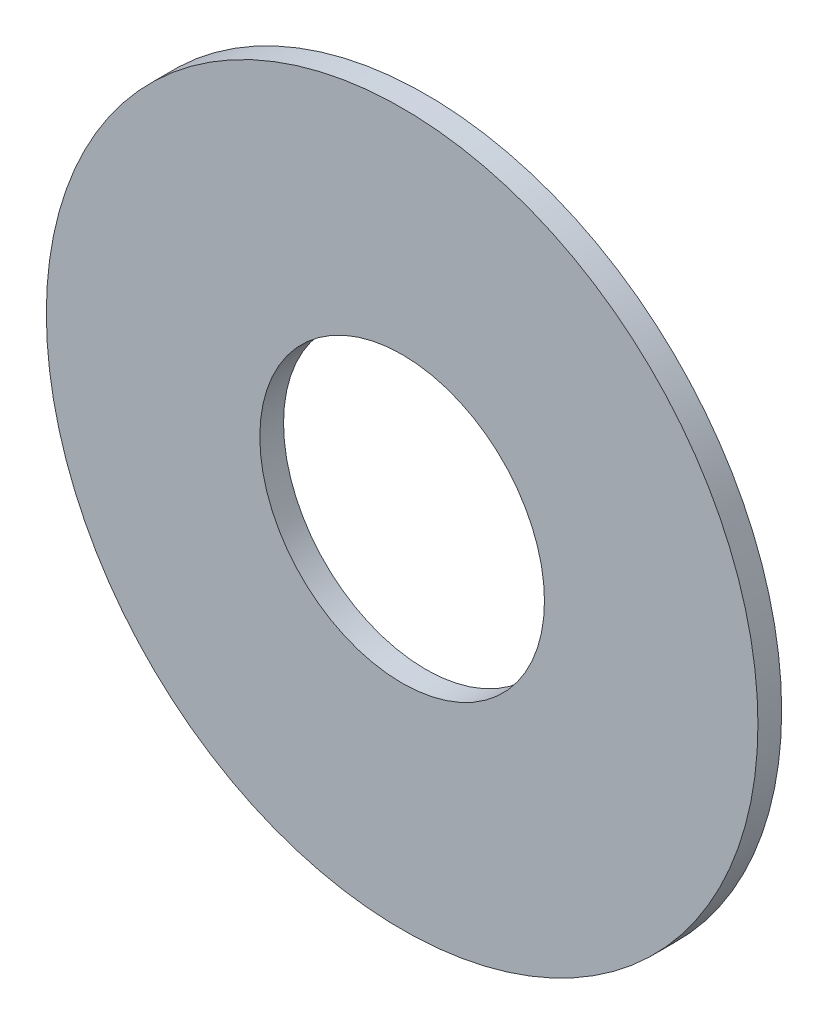
ISO-10303-21;
HEADER;
FILE_DESCRIPTION(('STEP AP214'),'2;1');
FILE_NAME('part.step','',(''),(''),'','','');
FILE_SCHEMA(('AUTOMOTIVE_DESIGN { 1 0 10303 214 1 1 1 1 }'));
ENDSEC;
DATA;
#1=APPLICATION_CONTEXT('core data for automotive mechanical design processes');
#2=APPLICATION_PROTOCOL_DEFINITION('international standard','automotive_design',2000,#1);
#3=PRODUCT_CONTEXT('',#1,'mechanical');
#4=PRODUCT('Part','Part','',(#3));
#5=PRODUCT_RELATED_PRODUCT_CATEGORY('part','',(#4));
#6=PRODUCT_DEFINITION_FORMATION('','',#4);
#7=PRODUCT_DEFINITION_CONTEXT('part definition',#1,'design');
#8=PRODUCT_DEFINITION('design','',#6,#7);
#9=PRODUCT_DEFINITION_SHAPE('','',#8);
#10=(LENGTH_UNIT() NAMED_UNIT(*) SI_UNIT(.MILLI.,.METRE.));
#11=(NAMED_UNIT(*) PLANE_ANGLE_UNIT() SI_UNIT($,.RADIAN.));
#12=(NAMED_UNIT(*) SI_UNIT($,.STERADIAN.) SOLID_ANGLE_UNIT());
#13=UNCERTAINTY_MEASURE_WITH_UNIT(LENGTH_MEASURE(1.E-05),#10,'distance_accuracy_value','');
#14=(GEOMETRIC_REPRESENTATION_CONTEXT(3) GLOBAL_UNCERTAINTY_ASSIGNED_CONTEXT((#13)) GLOBAL_UNIT_ASSIGNED_CONTEXT((#10,
#11,#12)) REPRESENTATION_CONTEXT('',''));
#15=CARTESIAN_POINT('',(0.,0.,0.));
#16=DIRECTION('',(0.,0.,1.));
#17=DIRECTION('',(1.,0.,0.));
#18=AXIS2_PLACEMENT_3D('',#15,#16,#17);
#19=CARTESIAN_POINT('',(0.,0.,1.));
#20=DIRECTION('',(0.,0.,1.));
#21=DIRECTION('',(1.,0.,0.));
#22=AXIS2_PLACEMENT_3D('',#19,#20,#21);
#23=PLANE('',#22);
#24=CARTESIAN_POINT('',(0.,0.,1.));
#25=DIRECTION('',(0.,0.,1.));
#26=DIRECTION('',(1.,0.,0.));
#27=AXIS2_PLACEMENT_3D('',#24,#25,#26);
#28=CIRCLE('',#27,15.);
#29=CARTESIAN_POINT('',(15.,0.,1.));
#30=VERTEX_POINT('',#29);
#31=EDGE_CURVE('E11',#30,#30,#28,.T.);
#32=ORIENTED_EDGE('',*,*,#31,.T.);
#33=EDGE_LOOP('',(#32));
#34=FACE_BOUND('',#33,.T.);
#35=CARTESIAN_POINT('',(0.,0.,1.));
#36=DIRECTION('',(0.,0.,1.));
#37=DIRECTION('',(1.,0.,0.));
#38=AXIS2_PLACEMENT_3D('',#35,#36,#37);
#39=CIRCLE('',#38,6.);
#40=CARTESIAN_POINT('',(6.,0.,1.));
#41=VERTEX_POINT('',#40);
#42=EDGE_CURVE('E56',#41,#41,#39,.T.);
#43=ORIENTED_EDGE('',*,*,#42,.F.);
#44=EDGE_LOOP('',(#43));
#45=FACE_BOUND('',#44,.T.);
#46=ADVANCED_FACE('F43',(#34,#45),#23,.T.);
#47=CARTESIAN_POINT('',(0.,0.,0.));
#48=DIRECTION('',(0.,0.,1.));
#49=DIRECTION('',(1.,0.,0.));
#50=AXIS2_PLACEMENT_3D('',#47,#48,#49);
#51=PLANE('',#50);
#52=CARTESIAN_POINT('',(0.,0.,0.));
#53=DIRECTION('',(0.,0.,1.));
#54=DIRECTION('',(1.,0.,0.));
#55=AXIS2_PLACEMENT_3D('',#52,#53,#54);
#56=CIRCLE('',#55,15.);
#57=CARTESIAN_POINT('',(15.,0.,0.));
#58=VERTEX_POINT('',#57);
#59=EDGE_CURVE('E47',#58,#58,#56,.T.);
#60=ORIENTED_EDGE('',*,*,#59,.F.);
#61=EDGE_LOOP('',(#60));
#62=FACE_BOUND('',#61,.T.);
#63=CARTESIAN_POINT('',(0.,0.,0.));
#64=DIRECTION('',(0.,0.,1.));
#65=DIRECTION('',(1.,0.,0.));
#66=AXIS2_PLACEMENT_3D('',#63,#64,#65);
#67=CIRCLE('',#66,6.);
#68=CARTESIAN_POINT('',(6.,0.,0.));
#69=VERTEX_POINT('',#68);
#70=EDGE_CURVE('E58',#69,#69,#67,.T.);
#71=ORIENTED_EDGE('',*,*,#70,.T.);
#72=EDGE_LOOP('',(#71));
#73=FACE_BOUND('',#72,.T.);
#74=ADVANCED_FACE('F70',(#62,#73),#51,.F.);
#75=CARTESIAN_POINT('',(0.,0.,1.));
#76=DIRECTION('',(0.,0.,-1.));
#77=DIRECTION('',(-1.,0.,0.));
#78=AXIS2_PLACEMENT_3D('',#75,#76,#77);
#79=CYLINDRICAL_SURFACE('',#78,15.);
#80=ORIENTED_EDGE('',*,*,#31,.F.);
#81=EDGE_LOOP('',(#80));
#82=FACE_BOUND('',#81,.T.);
#83=ORIENTED_EDGE('',*,*,#59,.T.);
#84=EDGE_LOOP('',(#83));
#85=FACE_BOUND('',#84,.T.);
#86=ADVANCED_FACE('F45',(#82,#85),#79,.T.);
#87=CARTESIAN_POINT('',(0.,0.,1.));
#88=DIRECTION('',(0.,0.,-1.));
#89=DIRECTION('',(-1.,0.,0.));
#90=AXIS2_PLACEMENT_3D('',#87,#88,#89);
#91=CYLINDRICAL_SURFACE('',#90,6.);
#92=ORIENTED_EDGE('',*,*,#42,.T.);
#93=EDGE_LOOP('',(#92));
#94=FACE_BOUND('',#93,.T.);
#95=ORIENTED_EDGE('',*,*,#70,.F.);
#96=EDGE_LOOP('',(#95));
#97=FACE_BOUND('',#96,.T.);
#98=ADVANCED_FACE('F66',(#94,#97),#91,.F.);
#99=CLOSED_SHELL('',(#46,#74,#86,#98));
#100=MANIFOLD_SOLID_BREP('B2',#99);
#101=ADVANCED_BREP_SHAPE_REPRESENTATION('',(#18,#100),#14);
#102=SHAPE_DEFINITION_REPRESENTATION(#9,#101);
ENDSEC;
END-ISO-10303-21;
